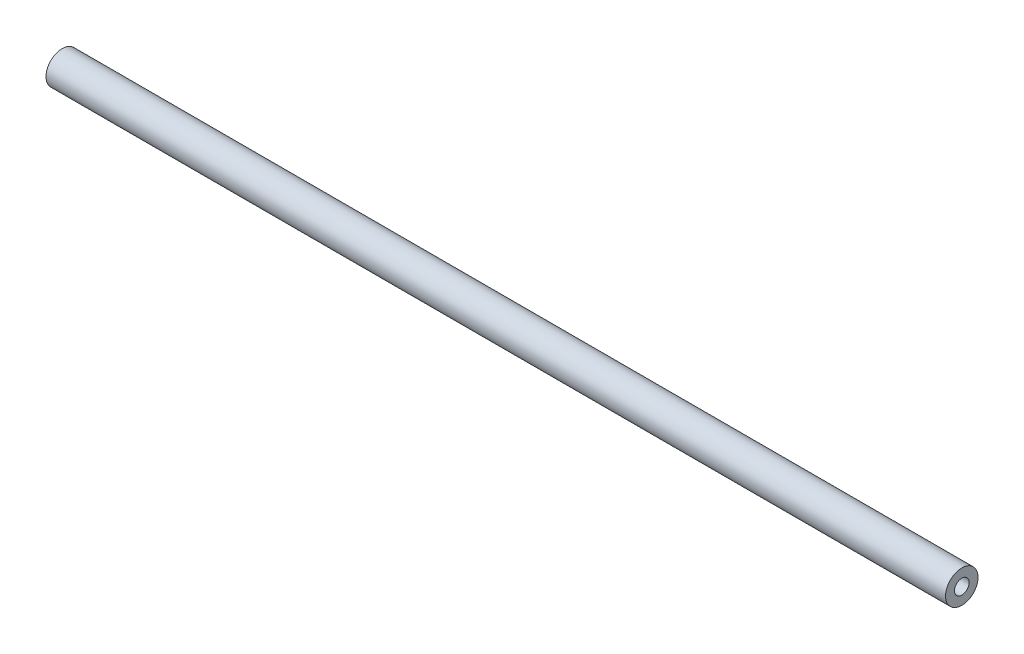
ISO-10303-21;
HEADER;
FILE_DESCRIPTION(('STEP AP214'),'2;1');
FILE_NAME('part.step','',(''),(''),'','','');
FILE_SCHEMA(('AUTOMOTIVE_DESIGN { 1 0 10303 214 1 1 1 1 }'));
ENDSEC;
DATA;
#1=APPLICATION_CONTEXT('core data for automotive mechanical design processes');
#2=APPLICATION_PROTOCOL_DEFINITION('international standard','automotive_design',2000,#1);
#3=PRODUCT_CONTEXT('',#1,'mechanical');
#4=PRODUCT('Part','Part','',(#3));
#5=PRODUCT_RELATED_PRODUCT_CATEGORY('part','',(#4));
#6=PRODUCT_DEFINITION_FORMATION('','',#4);
#7=PRODUCT_DEFINITION_CONTEXT('part definition',#1,'design');
#8=PRODUCT_DEFINITION('design','',#6,#7);
#9=PRODUCT_DEFINITION_SHAPE('','',#8);
#10=(LENGTH_UNIT() NAMED_UNIT(*) SI_UNIT(.MILLI.,.METRE.));
#11=(NAMED_UNIT(*) PLANE_ANGLE_UNIT() SI_UNIT($,.RADIAN.));
#12=(NAMED_UNIT(*) SI_UNIT($,.STERADIAN.) SOLID_ANGLE_UNIT());
#13=UNCERTAINTY_MEASURE_WITH_UNIT(LENGTH_MEASURE(1.E-05),#10,'distance_accuracy_value','');
#14=(GEOMETRIC_REPRESENTATION_CONTEXT(3) GLOBAL_UNCERTAINTY_ASSIGNED_CONTEXT((#13)) GLOBAL_UNIT_ASSIGNED_CONTEXT((#10,
#11,#12)) REPRESENTATION_CONTEXT('',''));
#15=CARTESIAN_POINT('',(0.,0.,0.));
#16=DIRECTION('',(0.,0.,1.));
#17=DIRECTION('',(1.,0.,0.));
#18=AXIS2_PLACEMENT_3D('',#15,#16,#17);
#19=CARTESIAN_POINT('',(-613.42,22.1651267806307,0.));
#20=DIRECTION('',(1.,0.,0.));
#21=DIRECTION('',(0.,0.,-1.));
#22=AXIS2_PLACEMENT_3D('',#19,#20,#21);
#23=PLANE('',#22);
#24=CARTESIAN_POINT('',(-613.42,12.6401267806307,0.));
#25=DIRECTION('',(-1.,0.,0.));
#26=DIRECTION('',(0.,0.,1.));
#27=AXIS2_PLACEMENT_3D('',#24,#25,#26);
#28=CIRCLE('',#27,4.30494980879351);
#29=CARTESIAN_POINT('',(-613.42,12.6401267806307,4.30494980879351));
#30=VERTEX_POINT('',#29);
#31=EDGE_CURVE('E11',#30,#30,#28,.T.);
#32=ORIENTED_EDGE('',*,*,#31,.F.);
#33=EDGE_LOOP('',(#32));
#34=FACE_BOUND('',#33,.T.);
#35=CARTESIAN_POINT('',(-613.42,12.6401267806307,0.));
#36=DIRECTION('',(-1.,0.,0.));
#37=DIRECTION('',(0.,0.,1.));
#38=AXIS2_PLACEMENT_3D('',#35,#36,#37);
#39=CIRCLE('',#38,9.525);
#40=CARTESIAN_POINT('',(-613.42,12.6401267806307,9.525));
#41=VERTEX_POINT('',#40);
#42=EDGE_CURVE('E61',#41,#41,#39,.T.);
#43=ORIENTED_EDGE('',*,*,#42,.T.);
#44=EDGE_LOOP('',(#43));
#45=FACE_BOUND('',#44,.T.);
#46=ADVANCED_FACE('F29',(#34,#45),#23,.F.);
#47=CARTESIAN_POINT('',(-686.612350472784,12.6401267806307,0.));
#48=DIRECTION('',(-1.,0.,0.));
#49=DIRECTION('',(0.,0.,1.));
#50=AXIS2_PLACEMENT_3D('',#47,#48,#49);
#51=CYLINDRICAL_SURFACE('',#50,4.30494980879356);
#52=CARTESIAN_POINT('',(-591.286245753739,12.6401267806307,0.));
#53=DIRECTION('',(-1.,0.,0.));
#54=DIRECTION('',(0.,0.,1.));
#55=AXIS2_PLACEMENT_3D('',#52,#53,#54);
#56=CIRCLE('',#55,4.30494980879361);
#57=CARTESIAN_POINT('',(-591.286245753739,12.6401267806307,4.30494980879361));
#58=VERTEX_POINT('',#57);
#59=EDGE_CURVE('E36',#58,#58,#56,.T.);
#60=ORIENTED_EDGE('',*,*,#59,.F.);
#61=EDGE_LOOP('',(#60));
#62=FACE_BOUND('',#61,.T.);
#63=ORIENTED_EDGE('',*,*,#31,.T.);
#64=EDGE_LOOP('',(#63));
#65=FACE_BOUND('',#64,.T.);
#66=ADVANCED_FACE('F46',(#62,#65),#51,.F.);
#67=CARTESIAN_POINT('',(-591.286245753739,12.6401267806307,0.));
#68=DIRECTION('',(-1.,0.,0.));
#69=DIRECTION('',(0.,0.,1.));
#70=AXIS2_PLACEMENT_3D('',#67,#68,#69);
#71=CONICAL_SURFACE('',#70,4.30494980879361,1.04719755119659);
#72=CARTESIAN_POINT('',(-588.800781822784,12.6401267806306,0.));
#73=VERTEX_POINT('',#72);
#74=VERTEX_LOOP('',#73);
#75=FACE_BOUND('',#74,.T.);
#76=ORIENTED_EDGE('',*,*,#59,.T.);
#77=EDGE_LOOP('',(#76));
#78=FACE_BOUND('',#77,.T.);
#79=ADVANCED_FACE('F42',(#75,#78),#71,.F.);
#80=CARTESIAN_POINT('',(-110.199218177216,12.6401267806307,0.));
#81=DIRECTION('',(1.,0.,0.));
#82=DIRECTION('',(0.,0.,-1.));
#83=AXIS2_PLACEMENT_3D('',#80,#81,#82);
#84=CONICAL_SURFACE('',#83,0.,1.04719755119664);
#85=CARTESIAN_POINT('',(-107.713754246262,12.6401267806307,0.));
#86=DIRECTION('',(-1.,0.,0.));
#87=DIRECTION('',(0.,0.,1.));
#88=AXIS2_PLACEMENT_3D('',#85,#86,#87);
#89=CIRCLE('',#88,4.30494980879356);
#90=CARTESIAN_POINT('',(-107.713754246262,12.6401267806307,4.30494980879356));
#91=VERTEX_POINT('',#90);
#92=EDGE_CURVE('E51',#91,#91,#89,.T.);
#93=ORIENTED_EDGE('',*,*,#92,.F.);
#94=EDGE_LOOP('',(#93));
#95=FACE_BOUND('',#94,.T.);
#96=CARTESIAN_POINT('',(-110.199218177216,12.6401267806307,0.));
#97=VERTEX_POINT('',#96);
#98=VERTEX_LOOP('',#97);
#99=FACE_BOUND('',#98,.T.);
#100=ADVANCED_FACE('F45',(#95,#99),#84,.F.);
#101=CARTESIAN_POINT('',(-686.612350472784,12.6401267806307,0.));
#102=DIRECTION('',(-1.,0.,0.));
#103=DIRECTION('',(0.,0.,1.));
#104=AXIS2_PLACEMENT_3D('',#101,#102,#103);
#105=CYLINDRICAL_SURFACE('',#104,4.30494980879356);
#106=CARTESIAN_POINT('',(-85.5800000000003,12.6401267806307,0.));
#107=DIRECTION('',(-1.,0.,0.));
#108=DIRECTION('',(0.,0.,1.));
#109=AXIS2_PLACEMENT_3D('',#106,#107,#108);
#110=CIRCLE('',#109,4.30494980879356);
#111=CARTESIAN_POINT('',(-85.5800000000003,12.6401267806307,4.30494980879356));
#112=VERTEX_POINT('',#111);
#113=EDGE_CURVE('E53',#112,#112,#110,.T.);
#114=ORIENTED_EDGE('',*,*,#113,.F.);
#115=EDGE_LOOP('',(#114));
#116=FACE_BOUND('',#115,.T.);
#117=ORIENTED_EDGE('',*,*,#92,.T.);
#118=EDGE_LOOP('',(#117));
#119=FACE_BOUND('',#118,.T.);
#120=ADVANCED_FACE('F75',(#116,#119),#105,.F.);
#121=CARTESIAN_POINT('',(-85.5800000000002,22.1651267806307,0.));
#122=DIRECTION('',(-1.,0.,0.));
#123=DIRECTION('',(0.,0.,1.));
#124=AXIS2_PLACEMENT_3D('',#121,#122,#123);
#125=PLANE('',#124);
#126=CARTESIAN_POINT('',(-85.58,12.6401267806307,0.));
#127=DIRECTION('',(-1.,0.,0.));
#128=DIRECTION('',(0.,0.,1.));
#129=AXIS2_PLACEMENT_3D('',#126,#127,#128);
#130=CIRCLE('',#129,9.525);
#131=CARTESIAN_POINT('',(-85.58,12.6401267806307,9.525));
#132=VERTEX_POINT('',#131);
#133=EDGE_CURVE('E58',#132,#132,#130,.T.);
#134=ORIENTED_EDGE('',*,*,#133,.F.);
#135=EDGE_LOOP('',(#134));
#136=FACE_BOUND('',#135,.T.);
#137=ORIENTED_EDGE('',*,*,#113,.T.);
#138=EDGE_LOOP('',(#137));
#139=FACE_BOUND('',#138,.T.);
#140=ADVANCED_FACE('F69',(#136,#139),#125,.F.);
#141=CARTESIAN_POINT('',(-686.612350472784,12.6401267806307,0.));
#142=DIRECTION('',(-1.,0.,0.));
#143=DIRECTION('',(0.,0.,1.));
#144=AXIS2_PLACEMENT_3D('',#141,#142,#143);
#145=CYLINDRICAL_SURFACE('',#144,9.525);
#146=ORIENTED_EDGE('',*,*,#42,.F.);
#147=EDGE_LOOP('',(#146));
#148=FACE_BOUND('',#147,.T.);
#149=ORIENTED_EDGE('',*,*,#133,.T.);
#150=EDGE_LOOP('',(#149));
#151=FACE_BOUND('',#150,.T.);
#152=ADVANCED_FACE('F66',(#148,#151),#145,.T.);
#153=CLOSED_SHELL('',(#46,#66,#79,#100,#120,#140,#152));
#154=MANIFOLD_SOLID_BREP('B2',#153);
#155=ADVANCED_BREP_SHAPE_REPRESENTATION('',(#18,#154),#14);
#156=SHAPE_DEFINITION_REPRESENTATION(#9,#155);
ENDSEC;
END-ISO-10303-21;
